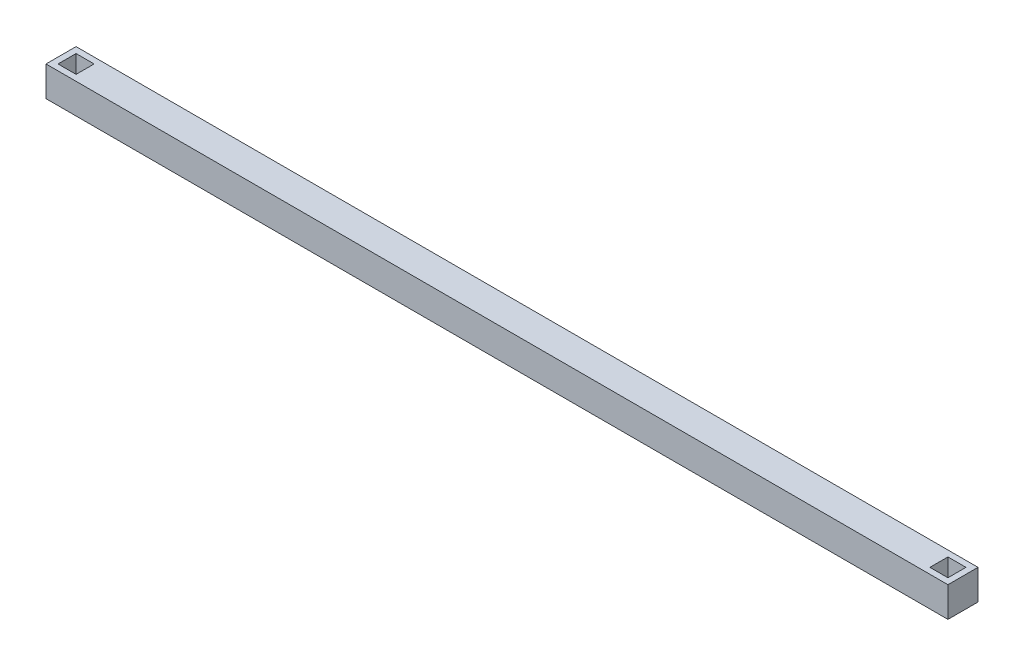
ISO-10303-21;
HEADER;
FILE_DESCRIPTION(('STEP AP214'),'2;1');
FILE_NAME('part.step','',(''),(''),'','','');
FILE_SCHEMA(('AUTOMOTIVE_DESIGN { 1 0 10303 214 1 1 1 1 }'));
ENDSEC;
DATA;
#1=APPLICATION_CONTEXT('core data for automotive mechanical design processes');
#2=APPLICATION_PROTOCOL_DEFINITION('international standard','automotive_design',2000,#1);
#3=PRODUCT_CONTEXT('',#1,'mechanical');
#4=PRODUCT('Part','Part','',(#3));
#5=PRODUCT_RELATED_PRODUCT_CATEGORY('part','',(#4));
#6=PRODUCT_DEFINITION_FORMATION('','',#4);
#7=PRODUCT_DEFINITION_CONTEXT('part definition',#1,'design');
#8=PRODUCT_DEFINITION('design','',#6,#7);
#9=PRODUCT_DEFINITION_SHAPE('','',#8);
#10=(LENGTH_UNIT() NAMED_UNIT(*) SI_UNIT(.MILLI.,.METRE.));
#11=(NAMED_UNIT(*) PLANE_ANGLE_UNIT() SI_UNIT($,.RADIAN.));
#12=(NAMED_UNIT(*) SI_UNIT($,.STERADIAN.) SOLID_ANGLE_UNIT());
#13=UNCERTAINTY_MEASURE_WITH_UNIT(LENGTH_MEASURE(1.E-05),#10,'distance_accuracy_value','');
#14=(GEOMETRIC_REPRESENTATION_CONTEXT(3) GLOBAL_UNCERTAINTY_ASSIGNED_CONTEXT((#13)) GLOBAL_UNIT_ASSIGNED_CONTEXT((#10,
#11,#12)) REPRESENTATION_CONTEXT('',''));
#15=CARTESIAN_POINT('',(0.,0.,0.));
#16=DIRECTION('',(0.,0.,1.));
#17=DIRECTION('',(1.,0.,0.));
#18=AXIS2_PLACEMENT_3D('',#15,#16,#17);
#19=CARTESIAN_POINT('',(-750.,25.,50.));
#20=DIRECTION('',(0.,-1.,0.));
#21=DIRECTION('',(0.,0.,-1.));
#22=AXIS2_PLACEMENT_3D('',#19,#20,#21);
#23=PLANE('',#22);
#24=DIRECTION('',(1.,0.,0.));
#25=VECTOR('',#24,1.);
#26=CARTESIAN_POINT('',(-740.,25.,10.));
#27=LINE('',#26,#25);
#28=CARTESIAN_POINT('',(-740.,25.,10.));
#29=VERTEX_POINT('',#28);
#30=CARTESIAN_POINT('',(-710.,25.,10.));
#31=VERTEX_POINT('',#30);
#32=EDGE_CURVE('E58',#29,#31,#27,.T.);
#33=ORIENTED_EDGE('',*,*,#32,.T.);
#34=DIRECTION('',(0.,0.,1.));
#35=VECTOR('',#34,1.);
#36=CARTESIAN_POINT('',(-710.,25.,10.));
#37=LINE('',#36,#35);
#38=CARTESIAN_POINT('',(-710.,25.,40.));
#39=VERTEX_POINT('',#38);
#40=EDGE_CURVE('E174',#31,#39,#37,.T.);
#41=ORIENTED_EDGE('',*,*,#40,.T.);
#42=DIRECTION('',(1.,0.,0.));
#43=VECTOR('',#42,1.);
#44=CARTESIAN_POINT('',(-740.,25.,40.));
#45=LINE('',#44,#43);
#46=CARTESIAN_POINT('',(-740.,25.,40.));
#47=VERTEX_POINT('',#46);
#48=EDGE_CURVE('E177',#47,#39,#45,.T.);
#49=ORIENTED_EDGE('',*,*,#48,.F.);
#50=DIRECTION('',(0.,0.,1.));
#51=VECTOR('',#50,1.);
#52=CARTESIAN_POINT('',(-740.,25.,10.));
#53=LINE('',#52,#51);
#54=EDGE_CURVE('E164',#29,#47,#53,.T.);
#55=ORIENTED_EDGE('',*,*,#54,.F.);
#56=EDGE_LOOP('',(#33,#41,#49,#55));
#57=FACE_BOUND('',#56,.T.);
#58=DIRECTION('',(-1.,0.,0.));
#59=VECTOR('',#58,1.);
#60=CARTESIAN_POINT('',(-750.,25.,0.));
#61=LINE('',#60,#59);
#62=CARTESIAN_POINT('',(750.,25.,0.));
#63=VERTEX_POINT('',#62);
#64=CARTESIAN_POINT('',(-750.,25.,0.));
#65=VERTEX_POINT('',#64);
#66=EDGE_CURVE('E203',#63,#65,#61,.T.);
#67=ORIENTED_EDGE('',*,*,#66,.T.);
#68=DIRECTION('',(0.,0.,-1.));
#69=VECTOR('',#68,1.);
#70=CARTESIAN_POINT('',(-750.,25.,50.));
#71=LINE('',#70,#69);
#72=CARTESIAN_POINT('',(-750.,25.,50.));
#73=VERTEX_POINT('',#72);
#74=EDGE_CURVE('E43',#73,#65,#71,.T.);
#75=ORIENTED_EDGE('',*,*,#74,.F.);
#76=DIRECTION('',(-1.,0.,0.));
#77=VECTOR('',#76,1.);
#78=CARTESIAN_POINT('',(-750.,25.,50.));
#79=LINE('',#78,#77);
#80=CARTESIAN_POINT('',(750.,25.,50.));
#81=VERTEX_POINT('',#80);
#82=EDGE_CURVE('E193',#81,#73,#79,.T.);
#83=ORIENTED_EDGE('',*,*,#82,.F.);
#84=DIRECTION('',(0.,0.,-1.));
#85=VECTOR('',#84,1.);
#86=CARTESIAN_POINT('',(750.,25.,50.));
#87=LINE('',#86,#85);
#88=EDGE_CURVE('E11',#81,#63,#87,.T.);
#89=ORIENTED_EDGE('',*,*,#88,.T.);
#90=EDGE_LOOP('',(#67,#75,#83,#89));
#91=FACE_BOUND('',#90,.T.);
#92=DIRECTION('',(1.,0.,0.));
#93=VECTOR('',#92,1.);
#94=CARTESIAN_POINT('',(710.,25.,10.));
#95=LINE('',#94,#93);
#96=CARTESIAN_POINT('',(710.,25.,10.));
#97=VERTEX_POINT('',#96);
#98=CARTESIAN_POINT('',(740.,25.,10.));
#99=VERTEX_POINT('',#98);
#100=EDGE_CURVE('E50',#97,#99,#95,.T.);
#101=ORIENTED_EDGE('',*,*,#100,.T.);
#102=DIRECTION('',(0.,0.,1.));
#103=VECTOR('',#102,1.);
#104=CARTESIAN_POINT('',(740.,25.,10.));
#105=LINE('',#104,#103);
#106=CARTESIAN_POINT('',(740.,25.,40.));
#107=VERTEX_POINT('',#106);
#108=EDGE_CURVE('E147',#99,#107,#105,.T.);
#109=ORIENTED_EDGE('',*,*,#108,.T.);
#110=DIRECTION('',(1.,0.,0.));
#111=VECTOR('',#110,1.);
#112=CARTESIAN_POINT('',(710.,25.,40.));
#113=LINE('',#112,#111);
#114=CARTESIAN_POINT('',(710.,25.,40.));
#115=VERTEX_POINT('',#114);
#116=EDGE_CURVE('E131',#115,#107,#113,.T.);
#117=ORIENTED_EDGE('',*,*,#116,.F.);
#118=DIRECTION('',(0.,0.,1.));
#119=VECTOR('',#118,1.);
#120=CARTESIAN_POINT('',(710.,25.,10.));
#121=LINE('',#120,#119);
#122=EDGE_CURVE('E142',#97,#115,#121,.T.);
#123=ORIENTED_EDGE('',*,*,#122,.F.);
#124=EDGE_LOOP('',(#101,#109,#117,#123));
#125=FACE_BOUND('',#124,.T.);
#126=ADVANCED_FACE('F35',(#57,#91,#125),#23,.F.);
#127=CARTESIAN_POINT('',(750.,25.,50.));
#128=DIRECTION('',(-1.,0.,0.));
#129=DIRECTION('',(0.,0.,1.));
#130=AXIS2_PLACEMENT_3D('',#127,#128,#129);
#131=PLANE('',#130);
#132=DIRECTION('',(0.,1.,0.));
#133=VECTOR('',#132,1.);
#134=CARTESIAN_POINT('',(750.,25.,0.));
#135=LINE('',#134,#133);
#136=CARTESIAN_POINT('',(750.,-25.,0.));
#137=VERTEX_POINT('',#136);
#138=EDGE_CURVE('E189',#137,#63,#135,.T.);
#139=ORIENTED_EDGE('',*,*,#138,.T.);
#140=ORIENTED_EDGE('',*,*,#88,.F.);
#141=DIRECTION('',(0.,1.,0.));
#142=VECTOR('',#141,1.);
#143=CARTESIAN_POINT('',(750.,25.,50.));
#144=LINE('',#143,#142);
#145=CARTESIAN_POINT('',(750.,-25.,50.));
#146=VERTEX_POINT('',#145);
#147=EDGE_CURVE('E190',#146,#81,#144,.T.);
#148=ORIENTED_EDGE('',*,*,#147,.F.);
#149=DIRECTION('',(0.,0.,-1.));
#150=VECTOR('',#149,1.);
#151=CARTESIAN_POINT('',(750.,-25.,50.));
#152=LINE('',#151,#150);
#153=EDGE_CURVE('E200',#146,#137,#152,.T.);
#154=ORIENTED_EDGE('',*,*,#153,.T.);
#155=EDGE_LOOP('',(#139,#140,#148,#154));
#156=FACE_BOUND('',#155,.T.);
#157=ADVANCED_FACE('F37',(#156),#131,.F.);
#158=CARTESIAN_POINT('',(-750.,25.,50.));
#159=DIRECTION('',(1.,0.,0.));
#160=DIRECTION('',(0.,0.,-1.));
#161=AXIS2_PLACEMENT_3D('',#158,#159,#160);
#162=PLANE('',#161);
#163=DIRECTION('',(0.,-1.,0.));
#164=VECTOR('',#163,1.);
#165=CARTESIAN_POINT('',(-750.,25.,0.));
#166=LINE('',#165,#164);
#167=CARTESIAN_POINT('',(-750.,-25.,0.));
#168=VERTEX_POINT('',#167);
#169=EDGE_CURVE('E205',#65,#168,#166,.T.);
#170=ORIENTED_EDGE('',*,*,#169,.T.);
#171=DIRECTION('',(0.,0.,-1.));
#172=VECTOR('',#171,1.);
#173=CARTESIAN_POINT('',(-750.,-25.,50.));
#174=LINE('',#173,#172);
#175=CARTESIAN_POINT('',(-750.,-25.,50.));
#176=VERTEX_POINT('',#175);
#177=EDGE_CURVE('E210',#176,#168,#174,.T.);
#178=ORIENTED_EDGE('',*,*,#177,.F.);
#179=DIRECTION('',(0.,-1.,0.));
#180=VECTOR('',#179,1.);
#181=CARTESIAN_POINT('',(-750.,25.,50.));
#182=LINE('',#181,#180);
#183=EDGE_CURVE('E196',#73,#176,#182,.T.);
#184=ORIENTED_EDGE('',*,*,#183,.F.);
#185=ORIENTED_EDGE('',*,*,#74,.T.);
#186=EDGE_LOOP('',(#170,#178,#184,#185));
#187=FACE_BOUND('',#186,.T.);
#188=ADVANCED_FACE('F217',(#187),#162,.F.);
#189=CARTESIAN_POINT('',(-750.,-25.,50.));
#190=DIRECTION('',(0.,1.,0.));
#191=DIRECTION('',(0.,0.,1.));
#192=AXIS2_PLACEMENT_3D('',#189,#190,#191);
#193=PLANE('',#192);
#194=DIRECTION('',(1.,0.,0.));
#195=VECTOR('',#194,1.);
#196=CARTESIAN_POINT('',(-750.,-25.,0.));
#197=LINE('',#196,#195);
#198=EDGE_CURVE('E194',#168,#137,#197,.T.);
#199=ORIENTED_EDGE('',*,*,#198,.T.);
#200=ORIENTED_EDGE('',*,*,#153,.F.);
#201=DIRECTION('',(1.,0.,0.));
#202=VECTOR('',#201,1.);
#203=CARTESIAN_POINT('',(-750.,-25.,50.));
#204=LINE('',#203,#202);
#205=EDGE_CURVE('E198',#176,#146,#204,.T.);
#206=ORIENTED_EDGE('',*,*,#205,.F.);
#207=ORIENTED_EDGE('',*,*,#177,.T.);
#208=EDGE_LOOP('',(#199,#200,#206,#207));
#209=FACE_BOUND('',#208,.T.);
#210=ADVANCED_FACE('F226',(#209),#193,.F.);
#211=CARTESIAN_POINT('',(0.,0.,50.));
#212=DIRECTION('',(0.,0.,1.));
#213=DIRECTION('',(1.,0.,0.));
#214=AXIS2_PLACEMENT_3D('',#211,#212,#213);
#215=PLANE('',#214);
#216=ORIENTED_EDGE('',*,*,#147,.T.);
#217=ORIENTED_EDGE('',*,*,#82,.T.);
#218=ORIENTED_EDGE('',*,*,#183,.T.);
#219=ORIENTED_EDGE('',*,*,#205,.T.);
#220=EDGE_LOOP('',(#216,#217,#218,#219));
#221=FACE_BOUND('',#220,.T.);
#222=ADVANCED_FACE('F232',(#221),#215,.T.);
#223=CARTESIAN_POINT('',(0.,0.,0.));
#224=DIRECTION('',(0.,0.,1.));
#225=DIRECTION('',(1.,0.,0.));
#226=AXIS2_PLACEMENT_3D('',#223,#224,#225);
#227=PLANE('',#226);
#228=ORIENTED_EDGE('',*,*,#138,.F.);
#229=ORIENTED_EDGE('',*,*,#198,.F.);
#230=ORIENTED_EDGE('',*,*,#169,.F.);
#231=ORIENTED_EDGE('',*,*,#66,.F.);
#232=EDGE_LOOP('',(#228,#229,#230,#231));
#233=FACE_BOUND('',#232,.T.);
#234=ADVANCED_FACE('F223',(#233),#227,.F.);
#235=CARTESIAN_POINT('',(-740.,-5.,10.));
#236=DIRECTION('',(0.,0.,1.));
#237=DIRECTION('',(1.,0.,0.));
#238=AXIS2_PLACEMENT_3D('',#235,#236,#237);
#239=PLANE('',#238);
#240=ORIENTED_EDGE('',*,*,#32,.F.);
#241=DIRECTION('',(0.,1.,0.));
#242=VECTOR('',#241,1.);
#243=CARTESIAN_POINT('',(-740.,-5.,10.));
#244=LINE('',#243,#242);
#245=CARTESIAN_POINT('',(-740.,-5.,10.));
#246=VERTEX_POINT('',#245);
#247=EDGE_CURVE('E172',#246,#29,#244,.T.);
#248=ORIENTED_EDGE('',*,*,#247,.F.);
#249=DIRECTION('',(1.,0.,0.));
#250=VECTOR('',#249,1.);
#251=CARTESIAN_POINT('',(-740.,-5.,10.));
#252=LINE('',#251,#250);
#253=CARTESIAN_POINT('',(-710.,-5.,10.));
#254=VERTEX_POINT('',#253);
#255=EDGE_CURVE('E160',#246,#254,#252,.T.);
#256=ORIENTED_EDGE('',*,*,#255,.T.);
#257=DIRECTION('',(0.,1.,0.));
#258=VECTOR('',#257,1.);
#259=CARTESIAN_POINT('',(-710.,-5.,10.));
#260=LINE('',#259,#258);
#261=EDGE_CURVE('E187',#254,#31,#260,.T.);
#262=ORIENTED_EDGE('',*,*,#261,.T.);
#263=EDGE_LOOP('',(#240,#248,#256,#262));
#264=FACE_BOUND('',#263,.T.);
#265=ADVANCED_FACE('F245',(#264),#239,.T.);
#266=CARTESIAN_POINT('',(-710.,-5.,10.));
#267=DIRECTION('',(-1.,0.,0.));
#268=DIRECTION('',(0.,0.,1.));
#269=AXIS2_PLACEMENT_3D('',#266,#267,#268);
#270=PLANE('',#269);
#271=ORIENTED_EDGE('',*,*,#40,.F.);
#272=ORIENTED_EDGE('',*,*,#261,.F.);
#273=DIRECTION('',(0.,0.,1.));
#274=VECTOR('',#273,1.);
#275=CARTESIAN_POINT('',(-710.,-5.,10.));
#276=LINE('',#275,#274);
#277=CARTESIAN_POINT('',(-710.,-5.,40.));
#278=VERTEX_POINT('',#277);
#279=EDGE_CURVE('E163',#254,#278,#276,.T.);
#280=ORIENTED_EDGE('',*,*,#279,.T.);
#281=DIRECTION('',(0.,1.,0.));
#282=VECTOR('',#281,1.);
#283=CARTESIAN_POINT('',(-710.,-5.,40.));
#284=LINE('',#283,#282);
#285=EDGE_CURVE('E185',#278,#39,#284,.T.);
#286=ORIENTED_EDGE('',*,*,#285,.T.);
#287=EDGE_LOOP('',(#271,#272,#280,#286));
#288=FACE_BOUND('',#287,.T.);
#289=ADVANCED_FACE('F250',(#288),#270,.T.);
#290=CARTESIAN_POINT('',(-740.,-5.,40.));
#291=DIRECTION('',(0.,0.,1.));
#292=DIRECTION('',(1.,0.,0.));
#293=AXIS2_PLACEMENT_3D('',#290,#291,#292);
#294=PLANE('',#293);
#295=ORIENTED_EDGE('',*,*,#48,.T.);
#296=ORIENTED_EDGE('',*,*,#285,.F.);
#297=DIRECTION('',(1.,0.,0.));
#298=VECTOR('',#297,1.);
#299=CARTESIAN_POINT('',(-740.,-5.,40.));
#300=LINE('',#299,#298);
#301=CARTESIAN_POINT('',(-740.,-5.,40.));
#302=VERTEX_POINT('',#301);
#303=EDGE_CURVE('E166',#302,#278,#300,.T.);
#304=ORIENTED_EDGE('',*,*,#303,.F.);
#305=DIRECTION('',(0.,1.,0.));
#306=VECTOR('',#305,1.);
#307=CARTESIAN_POINT('',(-740.,-5.,40.));
#308=LINE('',#307,#306);
#309=EDGE_CURVE('E183',#302,#47,#308,.T.);
#310=ORIENTED_EDGE('',*,*,#309,.T.);
#311=EDGE_LOOP('',(#295,#296,#304,#310));
#312=FACE_BOUND('',#311,.T.);
#313=ADVANCED_FACE('F253',(#312),#294,.F.);
#314=CARTESIAN_POINT('',(-740.,-5.,10.));
#315=DIRECTION('',(-1.,0.,0.));
#316=DIRECTION('',(0.,0.,1.));
#317=AXIS2_PLACEMENT_3D('',#314,#315,#316);
#318=PLANE('',#317);
#319=ORIENTED_EDGE('',*,*,#54,.T.);
#320=ORIENTED_EDGE('',*,*,#309,.F.);
#321=DIRECTION('',(0.,0.,1.));
#322=VECTOR('',#321,1.);
#323=CARTESIAN_POINT('',(-740.,-5.,10.));
#324=LINE('',#323,#322);
#325=EDGE_CURVE('E169',#246,#302,#324,.T.);
#326=ORIENTED_EDGE('',*,*,#325,.F.);
#327=ORIENTED_EDGE('',*,*,#247,.T.);
#328=EDGE_LOOP('',(#319,#320,#326,#327));
#329=FACE_BOUND('',#328,.T.);
#330=ADVANCED_FACE('F257',(#329),#318,.F.);
#331=CARTESIAN_POINT('',(0.,-5.,0.));
#332=DIRECTION('',(0.,-1.,0.));
#333=DIRECTION('',(0.,0.,-1.));
#334=AXIS2_PLACEMENT_3D('',#331,#332,#333);
#335=PLANE('',#334);
#336=ORIENTED_EDGE('',*,*,#255,.F.);
#337=ORIENTED_EDGE('',*,*,#325,.T.);
#338=ORIENTED_EDGE('',*,*,#303,.T.);
#339=ORIENTED_EDGE('',*,*,#279,.F.);
#340=EDGE_LOOP('',(#336,#337,#338,#339));
#341=FACE_BOUND('',#340,.T.);
#342=ADVANCED_FACE('F261',(#341),#335,.F.);
#343=CARTESIAN_POINT('',(710.,-5.,10.));
#344=DIRECTION('',(0.,0.,1.));
#345=DIRECTION('',(1.,0.,0.));
#346=AXIS2_PLACEMENT_3D('',#343,#344,#345);
#347=PLANE('',#346);
#348=ORIENTED_EDGE('',*,*,#100,.F.);
#349=DIRECTION('',(0.,1.,0.));
#350=VECTOR('',#349,1.);
#351=CARTESIAN_POINT('',(710.,-5.,10.));
#352=LINE('',#351,#350);
#353=CARTESIAN_POINT('',(710.,-5.,10.));
#354=VERTEX_POINT('',#353);
#355=EDGE_CURVE('E138',#354,#97,#352,.T.);
#356=ORIENTED_EDGE('',*,*,#355,.F.);
#357=DIRECTION('',(1.,0.,0.));
#358=VECTOR('',#357,1.);
#359=CARTESIAN_POINT('',(710.,-5.,10.));
#360=LINE('',#359,#358);
#361=CARTESIAN_POINT('',(740.,-5.,10.));
#362=VERTEX_POINT('',#361);
#363=EDGE_CURVE('E145',#354,#362,#360,.T.);
#364=ORIENTED_EDGE('',*,*,#363,.T.);
#365=DIRECTION('',(0.,1.,0.));
#366=VECTOR('',#365,1.);
#367=CARTESIAN_POINT('',(740.,-5.,10.));
#368=LINE('',#367,#366);
#369=EDGE_CURVE('E375',#362,#99,#368,.T.);
#370=ORIENTED_EDGE('',*,*,#369,.T.);
#371=EDGE_LOOP('',(#348,#356,#364,#370));
#372=FACE_BOUND('',#371,.T.);
#373=ADVANCED_FACE('F265',(#372),#347,.T.);
#374=CARTESIAN_POINT('',(740.,-5.,10.));
#375=DIRECTION('',(-1.,0.,0.));
#376=DIRECTION('',(0.,0.,1.));
#377=AXIS2_PLACEMENT_3D('',#374,#375,#376);
#378=PLANE('',#377);
#379=ORIENTED_EDGE('',*,*,#108,.F.);
#380=ORIENTED_EDGE('',*,*,#369,.F.);
#381=DIRECTION('',(0.,0.,1.));
#382=VECTOR('',#381,1.);
#383=CARTESIAN_POINT('',(740.,-5.,10.));
#384=LINE('',#383,#382);
#385=CARTESIAN_POINT('',(740.,-5.,40.));
#386=VERTEX_POINT('',#385);
#387=EDGE_CURVE('E156',#362,#386,#384,.T.);
#388=ORIENTED_EDGE('',*,*,#387,.T.);
#389=DIRECTION('',(0.,1.,0.));
#390=VECTOR('',#389,1.);
#391=CARTESIAN_POINT('',(740.,-5.,40.));
#392=LINE('',#391,#390);
#393=EDGE_CURVE('E139',#386,#107,#392,.T.);
#394=ORIENTED_EDGE('',*,*,#393,.T.);
#395=EDGE_LOOP('',(#379,#380,#388,#394));
#396=FACE_BOUND('',#395,.T.);
#397=ADVANCED_FACE('F275',(#396),#378,.T.);
#398=CARTESIAN_POINT('',(710.,-5.,40.));
#399=DIRECTION('',(0.,0.,1.));
#400=DIRECTION('',(1.,0.,0.));
#401=AXIS2_PLACEMENT_3D('',#398,#399,#400);
#402=PLANE('',#401);
#403=ORIENTED_EDGE('',*,*,#116,.T.);
#404=ORIENTED_EDGE('',*,*,#393,.F.);
#405=DIRECTION('',(1.,0.,0.));
#406=VECTOR('',#405,1.);
#407=CARTESIAN_POINT('',(710.,-5.,40.));
#408=LINE('',#407,#406);
#409=CARTESIAN_POINT('',(710.,-5.,40.));
#410=VERTEX_POINT('',#409);
#411=EDGE_CURVE('E134',#410,#386,#408,.T.);
#412=ORIENTED_EDGE('',*,*,#411,.F.);
#413=DIRECTION('',(0.,1.,0.));
#414=VECTOR('',#413,1.);
#415=CARTESIAN_POINT('',(710.,-5.,40.));
#416=LINE('',#415,#414);
#417=EDGE_CURVE('E126',#410,#115,#416,.T.);
#418=ORIENTED_EDGE('',*,*,#417,.T.);
#419=EDGE_LOOP('',(#403,#404,#412,#418));
#420=FACE_BOUND('',#419,.T.);
#421=ADVANCED_FACE('F128',(#420),#402,.F.);
#422=CARTESIAN_POINT('',(710.,-5.,10.));
#423=DIRECTION('',(-1.,0.,0.));
#424=DIRECTION('',(0.,0.,1.));
#425=AXIS2_PLACEMENT_3D('',#422,#423,#424);
#426=PLANE('',#425);
#427=ORIENTED_EDGE('',*,*,#122,.T.);
#428=ORIENTED_EDGE('',*,*,#417,.F.);
#429=DIRECTION('',(0.,0.,1.));
#430=VECTOR('',#429,1.);
#431=CARTESIAN_POINT('',(710.,-5.,10.));
#432=LINE('',#431,#430);
#433=EDGE_CURVE('E153',#354,#410,#432,.T.);
#434=ORIENTED_EDGE('',*,*,#433,.F.);
#435=ORIENTED_EDGE('',*,*,#355,.T.);
#436=EDGE_LOOP('',(#427,#428,#434,#435));
#437=FACE_BOUND('',#436,.T.);
#438=ADVANCED_FACE('F143',(#437),#426,.F.);
#439=CARTESIAN_POINT('',(0.,-5.,0.));
#440=DIRECTION('',(0.,-1.,0.));
#441=DIRECTION('',(0.,0.,-1.));
#442=AXIS2_PLACEMENT_3D('',#439,#440,#441);
#443=PLANE('',#442);
#444=ORIENTED_EDGE('',*,*,#363,.F.);
#445=ORIENTED_EDGE('',*,*,#433,.T.);
#446=ORIENTED_EDGE('',*,*,#411,.T.);
#447=ORIENTED_EDGE('',*,*,#387,.F.);
#448=EDGE_LOOP('',(#444,#445,#446,#447));
#449=FACE_BOUND('',#448,.T.);
#450=ADVANCED_FACE('F267',(#449),#443,.F.);
#451=CLOSED_SHELL('',(#126,#157,#188,#210,#222,#234,#265,#289,#313,#330,#342,#373,#397,#421,
#438,#450));
#452=MANIFOLD_SOLID_BREP('B2',#451);
#453=ADVANCED_BREP_SHAPE_REPRESENTATION('',(#18,#452),#14);
#454=SHAPE_DEFINITION_REPRESENTATION(#9,#453);
ENDSEC;
END-ISO-10303-21;
